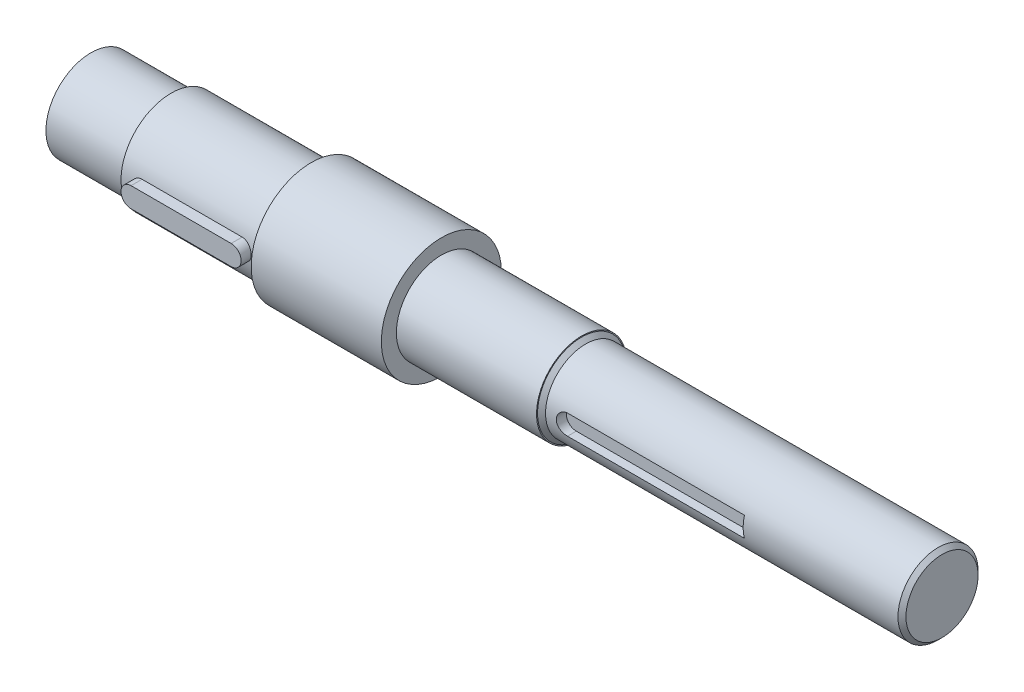
ISO-10303-21;
HEADER;
FILE_DESCRIPTION(('STEP AP214'),'2;1');
FILE_NAME('part.step','',(''),(''),'','','');
FILE_SCHEMA(('AUTOMOTIVE_DESIGN { 1 0 10303 214 1 1 1 1 }'));
ENDSEC;
DATA;
#1=APPLICATION_CONTEXT('core data for automotive mechanical design processes');
#2=APPLICATION_PROTOCOL_DEFINITION('international standard','automotive_design',2000,#1);
#3=PRODUCT_CONTEXT('',#1,'mechanical');
#4=PRODUCT('Part','Part','',(#3));
#5=PRODUCT_RELATED_PRODUCT_CATEGORY('part','',(#4));
#6=PRODUCT_DEFINITION_FORMATION('','',#4);
#7=PRODUCT_DEFINITION_CONTEXT('part definition',#1,'design');
#8=PRODUCT_DEFINITION('design','',#6,#7);
#9=PRODUCT_DEFINITION_SHAPE('','',#8);
#10=(LENGTH_UNIT() NAMED_UNIT(*) SI_UNIT(.MILLI.,.METRE.));
#11=(NAMED_UNIT(*) PLANE_ANGLE_UNIT() SI_UNIT($,.RADIAN.));
#12=(NAMED_UNIT(*) SI_UNIT($,.STERADIAN.) SOLID_ANGLE_UNIT());
#13=UNCERTAINTY_MEASURE_WITH_UNIT(LENGTH_MEASURE(1.E-05),#10,'distance_accuracy_value','');
#14=(GEOMETRIC_REPRESENTATION_CONTEXT(3) GLOBAL_UNCERTAINTY_ASSIGNED_CONTEXT((#13)) GLOBAL_UNIT_ASSIGNED_CONTEXT((#10,
#11,#12)) REPRESENTATION_CONTEXT('',''));
#15=CARTESIAN_POINT('',(0.,0.,0.));
#16=DIRECTION('',(0.,0.,1.));
#17=DIRECTION('',(1.,0.,0.));
#18=AXIS2_PLACEMENT_3D('',#15,#16,#17);
#19=CARTESIAN_POINT('',(325.,0.,0.));
#20=DIRECTION('',(1.,0.,0.));
#21=DIRECTION('',(0.,0.,-1.));
#22=AXIS2_PLACEMENT_3D('',#19,#20,#21);
#23=CYLINDRICAL_SURFACE('',#22,20.);
#24=DIRECTION('',(1.,0.,0.));
#25=VECTOR('',#24,1.);
#26=CARTESIAN_POINT('',(325.,-5.,19.3649167310371));
#27=LINE('',#26,#25);
#28=CARTESIAN_POINT('',(345.693163578946,-5.,19.3649167310371));
#29=VERTEX_POINT('',#28);
#30=CARTESIAN_POINT('',(257.357014360562,-5.,19.3649167310371));
#31=VERTEX_POINT('',#30);
#32=EDGE_CURVE('E65',#29,#31,#27,.F.);
#33=ORIENTED_EDGE('',*,*,#32,.T.);
#34=CARTESIAN_POINT('',(257.357014360562,-5.,19.3649167310371));
#35=CARTESIAN_POINT('',(257.218741410235,-5.00001753405856,19.3649007839448));
#36=CARTESIAN_POINT('',(257.080474031308,-4.9942649594992,19.3663971752211));
#37=CARTESIAN_POINT('',(256.804973201738,-4.97134855568943,19.3722985604214));
#38=CARTESIAN_POINT('',(256.667739581045,-4.95418664661752,19.3767030649124));
#39=CARTESIAN_POINT('',(256.39555097828,-4.90862550526641,19.3882932151163));
#40=CARTESIAN_POINT('',(256.260592030224,-4.8802485399566,19.395473349332));
#41=CARTESIAN_POINT('',(255.993627598963,-4.8124981930994,19.4123951927565));
#42=CARTESIAN_POINT('',(255.8616221564,-4.77312466032893,19.4221369371921));
#43=CARTESIAN_POINT('',(255.601517220398,-4.68370982441759,19.4438929800907));
#44=CARTESIAN_POINT('',(255.473416514375,-4.63367187241133,19.4559065645285));
#45=CARTESIAN_POINT('',(255.221886629321,-4.52328421223625,19.4818662950644));
#46=CARTESIAN_POINT('',(255.098459203696,-4.4629306796091,19.4958131575534));
#47=CARTESIAN_POINT('',(254.857143285893,-4.33237373804702,19.5252403930813));
#48=CARTESIAN_POINT('',(254.739254077098,-4.26217160818173,19.5407205669073));
#49=CARTESIAN_POINT('',(254.509702438924,-4.11237230752997,19.5727939032117));
#50=CARTESIAN_POINT('',(254.398042375446,-4.03277160234962,19.5893874833745));
#51=CARTESIAN_POINT('',(254.179602288399,-3.86310059131535,19.6235594213257));
#52=CARTESIAN_POINT('',(254.072958349297,-3.77285762537103,19.6411506158731));
#53=CARTESIAN_POINT('',(253.867571111575,-3.58375217632145,19.6765336016142));
#54=CARTESIAN_POINT('',(253.768830760125,-3.48488650634642,19.6943254648398));
#55=CARTESIAN_POINT('',(253.579962543264,-3.27923259691246,19.7296100663421));
#56=CARTESIAN_POINT('',(253.489832921767,-3.17244598079041,19.7471028650105));
#57=CARTESIAN_POINT('',(253.318739858616,-2.95158589140583,19.781320245822));
#58=CARTESIAN_POINT('',(253.237779806131,-2.83750974806656,19.7980445425702));
#59=CARTESIAN_POINT('',(253.084593656647,-2.60125165700148,19.8304789838686));
#60=CARTESIAN_POINT('',(253.012501461753,-2.4789805031238,19.846172223018));
#61=CARTESIAN_POINT('',(252.878871982133,-2.2285404858788,19.8758524753698));
#62=CARTESIAN_POINT('',(252.817338688003,-2.10036941582537,19.8898388429088));
#63=CARTESIAN_POINT('',(252.705374876027,-1.83913888991785,19.9156918575848));
#64=CARTESIAN_POINT('',(252.654938418928,-1.70608209372191,19.9275596379879));
#65=CARTESIAN_POINT('',(252.565525439476,-1.43592780474634,19.9488465917985));
#66=CARTESIAN_POINT('',(252.526553030436,-1.29882888101133,19.9582648861874));
#67=CARTESIAN_POINT('',(252.461111794983,-1.02449944050252,19.9742050419042));
#68=CARTESIAN_POINT('',(252.434401759068,-0.887329906187969,19.9807826130628));
#69=CARTESIAN_POINT('',(252.392532166258,-0.61112147007305,19.9911405771331));
#70=CARTESIAN_POINT('',(252.377376855634,-0.47208190013247,19.9949199417111));
#71=CARTESIAN_POINT('',(252.349525995907,-0.0538316503971066,20.0018595987671));
#72=CARTESIAN_POINT('',(252.354364629471,0.226850517941071,20.0006416404337));
#73=CARTESIAN_POINT('',(252.410156239347,0.776805470835619,19.9867651529638));
#74=CARTESIAN_POINT('',(252.460083279682,1.04619321655979,19.9743611583353));
#75=CARTESIAN_POINT('',(252.602961920538,1.57268384713161,19.9398153073034));
#76=CARTESIAN_POINT('',(252.695915424676,1.82978618788151,19.9176730200515));
#77=CARTESIAN_POINT('',(252.923011968746,2.32703221656296,19.8657515159188));
#78=CARTESIAN_POINT('',(253.057520231614,2.56700133265149,19.835904985373));
#79=CARTESIAN_POINT('',(253.36376111453,3.02140997555177,19.7717919823027));
#80=CARTESIAN_POINT('',(253.535499342586,3.23584564867366,19.7375248442104));
#81=CARTESIAN_POINT('',(253.819927784376,3.53678494662043,19.6850697901596));
#82=CARTESIAN_POINT('',(253.920753671691,3.63481635600628,19.6671607784857));
#83=CARTESIAN_POINT('',(254.130317007796,3.82205900545833,19.6316306769696));
#84=CARTESIAN_POINT('',(254.239051654558,3.91127334319107,19.6140094878371));
#85=CARTESIAN_POINT('',(254.463797091708,4.08032945790285,19.5795395310849));
#86=CARTESIAN_POINT('',(254.579812624056,4.16016502733274,19.5626912794969));
#87=CARTESIAN_POINT('',(254.818248826518,4.30981088668676,19.5302685472816));
#88=CARTESIAN_POINT('',(254.940666999543,4.37962504585707,19.5146935760486));
#89=CARTESIAN_POINT('',(255.191854582385,4.50912025416738,19.4851808747872));
#90=CARTESIAN_POINT('',(255.320656784817,4.56874001933992,19.4712531918425));
#91=CARTESIAN_POINT('',(255.582999390997,4.67685682835969,19.4455675792789));
#92=CARTESIAN_POINT('',(255.716537879086,4.72535831123083,19.4338087840894));
#93=CARTESIAN_POINT('',(255.987298522453,4.81082238230289,19.4128288796263));
#94=CARTESIAN_POINT('',(256.124516702289,4.84779691847633,19.4036051438817));
#95=CARTESIAN_POINT('',(256.401700534934,4.9099426208801,19.3879727962744));
#96=CARTESIAN_POINT('',(256.541664868478,4.93511931688208,19.3815628656409));
#97=CARTESIAN_POINT('',(256.794271834071,4.96951196173161,19.3727696898981));
#98=CARTESIAN_POINT('',(256.906598173399,4.98094835236985,19.3698287297098));
#99=CARTESIAN_POINT('',(257.131617989406,4.99618938185625,19.365900549509));
#100=CARTESIAN_POINT('',(257.244310575182,5.00000636815257,19.3649101685657));
#101=CARTESIAN_POINT('',(257.357014360562,5.,19.3649167310371));
#102=B_SPLINE_CURVE_WITH_KNOTS('',3,(#34,#35,#36,#37,#38,#39,#40,#41,#42,#43,#44,#45,#46,#47,
#48,#49,#50,#51,#52,#53,#54,#55,#56,#57,#58,#59,#60,#61,#62,#63,#64,#65,#66,#67,#68,#69,#70,#71,
#72,#73,#74,#75,#76,#77,#78,#79,#80,#81,#82,#83,#84,#85,#86,#87,#88,#89,#90,#91,#92,#93,#94,#95,
#96,#97,#98,#99,#100,#101),.UNSPECIFIED.,.F.,.F.,(4,2,2,2,2,2,2,2,2,2,2,2,2,2,2,2,2,2,2,2,2,2,2,
2,2,2,2,2,2,2,2,2,2,4),(0.,0.414682651698812,0.829295530423234,1.24308931715182,
1.65688879458828,2.07055843292849,2.48438177155301,2.89815141525148,3.3120771582294,
3.73400550955301,4.15609046783011,4.57808916078638,5.00024332341806,5.42814441562206,
5.85620687281817,6.28403966195077,6.71202577127489,7.13118853175626,7.5505052571135,
8.38810249417921,9.20710845531106,10.0261506551392,10.852606653866,11.6791872295637,
12.104066664202,12.5287962930148,12.95380547348,13.3786501148241,13.8059651975176,
14.2331093744515,14.6598093221411,15.0863090705412,15.4248791296956,15.7629000801682),.UNSPECIFIED.);
#103=CARTESIAN_POINT('',(257.357014360562,5.,19.3649167310371));
#104=VERTEX_POINT('',#103);
#105=EDGE_CURVE('E194',#31,#104,#102,.T.);
#106=ORIENTED_EDGE('',*,*,#105,.T.);
#107=DIRECTION('',(1.,0.,0.));
#108=VECTOR('',#107,1.);
#109=CARTESIAN_POINT('',(325.,5.,19.3649167310371));
#110=LINE('',#109,#108);
#111=CARTESIAN_POINT('',(345.693163578946,5.,19.3649167310371));
#112=VERTEX_POINT('',#111);
#113=EDGE_CURVE('E465',#104,#112,#110,.T.);
#114=ORIENTED_EDGE('',*,*,#113,.T.);
#115=CARTESIAN_POINT('',(345.693163578946,0.,0.));
#116=DIRECTION('',(1.,0.,0.));
#117=DIRECTION('',(0.,0.,-1.));
#118=AXIS2_PLACEMENT_3D('',#115,#116,#117);
#119=CIRCLE('',#118,20.);
#120=EDGE_CURVE('E57',#112,#29,#119,.T.);
#121=ORIENTED_EDGE('',*,*,#120,.T.);
#122=EDGE_LOOP('',(#33,#106,#114,#121));
#123=FACE_BOUND('',#122,.T.);
#124=CARTESIAN_POINT('',(247.,0.,0.));
#125=DIRECTION('',(-1.,0.,0.));
#126=DIRECTION('',(0.,0.,1.));
#127=AXIS2_PLACEMENT_3D('',#124,#125,#126);
#128=CIRCLE('',#127,20.);
#129=CARTESIAN_POINT('',(247.,0.,20.));
#130=VERTEX_POINT('',#129);
#131=EDGE_CURVE('E185',#130,#130,#128,.F.);
#132=ORIENTED_EDGE('',*,*,#131,.T.);
#133=EDGE_LOOP('',(#132));
#134=FACE_BOUND('',#133,.T.);
#135=CARTESIAN_POINT('',(423.,0.,0.));
#136=DIRECTION('',(-1.,0.,0.));
#137=DIRECTION('',(0.,0.,1.));
#138=AXIS2_PLACEMENT_3D('',#135,#136,#137);
#139=CIRCLE('',#138,20.);
#140=CARTESIAN_POINT('',(423.,0.,20.));
#141=VERTEX_POINT('',#140);
#142=EDGE_CURVE('E182',#141,#141,#139,.T.);
#143=ORIENTED_EDGE('',*,*,#142,.T.);
#144=EDGE_LOOP('',(#143));
#145=FACE_BOUND('',#144,.T.);
#146=ADVANCED_FACE('F41',(#123,#134,#145),#23,.T.);
#147=CARTESIAN_POINT('',(245.,0.,0.));
#148=DIRECTION('',(-1.,0.,0.));
#149=DIRECTION('',(0.,0.,1.));
#150=AXIS2_PLACEMENT_3D('',#147,#148,#149);
#151=PLANE('',#150);
#152=CARTESIAN_POINT('',(245.,0.,0.));
#153=DIRECTION('',(-1.,0.,0.));
#154=DIRECTION('',(0.,0.,1.));
#155=AXIS2_PLACEMENT_3D('',#152,#153,#154);
#156=CIRCLE('',#155,22.0000000000001);
#157=CARTESIAN_POINT('',(245.,0.,22.0000000000001));
#158=VERTEX_POINT('',#157);
#159=EDGE_CURVE('E188',#158,#158,#156,.T.);
#160=ORIENTED_EDGE('',*,*,#159,.T.);
#161=EDGE_LOOP('',(#160));
#162=FACE_BOUND('',#161,.T.);
#163=CARTESIAN_POINT('',(245.,0.,0.));
#164=DIRECTION('',(1.,0.,0.));
#165=DIRECTION('',(0.,0.,-1.));
#166=AXIS2_PLACEMENT_3D('',#163,#164,#165);
#167=CIRCLE('',#166,22.5);
#168=CARTESIAN_POINT('',(245.,0.,-22.5));
#169=VERTEX_POINT('',#168);
#170=EDGE_CURVE('E179',#169,#169,#167,.T.);
#171=ORIENTED_EDGE('',*,*,#170,.T.);
#172=EDGE_LOOP('',(#171));
#173=FACE_BOUND('',#172,.T.);
#174=ADVANCED_FACE('F270',(#162,#173),#151,.F.);
#175=CARTESIAN_POINT('',(325.,0.,0.));
#176=DIRECTION('',(1.,0.,0.));
#177=DIRECTION('',(0.,0.,-1.));
#178=AXIS2_PLACEMENT_3D('',#175,#176,#177);
#179=CYLINDRICAL_SURFACE('',#178,22.5);
#180=ORIENTED_EDGE('',*,*,#170,.F.);
#181=EDGE_LOOP('',(#180));
#182=FACE_BOUND('',#181,.T.);
#183=CARTESIAN_POINT('',(175.,0.,0.));
#184=DIRECTION('',(1.,0.,0.));
#185=DIRECTION('',(0.,0.,-1.));
#186=AXIS2_PLACEMENT_3D('',#183,#184,#185);
#187=CIRCLE('',#186,22.5);
#188=CARTESIAN_POINT('',(175.,0.,-22.5));
#189=VERTEX_POINT('',#188);
#190=EDGE_CURVE('E176',#189,#189,#187,.T.);
#191=ORIENTED_EDGE('',*,*,#190,.T.);
#192=EDGE_LOOP('',(#191));
#193=FACE_BOUND('',#192,.T.);
#194=ADVANCED_FACE('F275',(#182,#193),#179,.T.);
#195=CARTESIAN_POINT('',(175.,0.,0.));
#196=DIRECTION('',(-1.,0.,0.));
#197=DIRECTION('',(0.,0.,1.));
#198=AXIS2_PLACEMENT_3D('',#195,#196,#197);
#199=PLANE('',#198);
#200=ORIENTED_EDGE('',*,*,#190,.F.);
#201=EDGE_LOOP('',(#200));
#202=FACE_BOUND('',#201,.T.);
#203=CARTESIAN_POINT('',(175.,0.,0.));
#204=DIRECTION('',(1.,0.,0.));
#205=DIRECTION('',(0.,0.,-1.));
#206=AXIS2_PLACEMENT_3D('',#203,#204,#205);
#207=CIRCLE('',#206,30.);
#208=CARTESIAN_POINT('',(175.,0.,-30.));
#209=VERTEX_POINT('',#208);
#210=EDGE_CURVE('E173',#209,#209,#207,.T.);
#211=ORIENTED_EDGE('',*,*,#210,.T.);
#212=EDGE_LOOP('',(#211));
#213=FACE_BOUND('',#212,.T.);
#214=ADVANCED_FACE('F303',(#202,#213),#199,.F.);
#215=CARTESIAN_POINT('',(325.,0.,0.));
#216=DIRECTION('',(1.,0.,0.));
#217=DIRECTION('',(0.,0.,-1.));
#218=AXIS2_PLACEMENT_3D('',#215,#216,#217);
#219=CYLINDRICAL_SURFACE('',#218,30.);
#220=ORIENTED_EDGE('',*,*,#210,.F.);
#221=EDGE_LOOP('',(#220));
#222=FACE_BOUND('',#221,.T.);
#223=CARTESIAN_POINT('',(110.,0.,0.));
#224=DIRECTION('',(1.,0.,0.));
#225=DIRECTION('',(0.,0.,-1.));
#226=AXIS2_PLACEMENT_3D('',#223,#224,#225);
#227=CIRCLE('',#226,30.);
#228=CARTESIAN_POINT('',(110.,0.,-30.));
#229=VERTEX_POINT('',#228);
#230=EDGE_CURVE('E170',#229,#229,#227,.T.);
#231=ORIENTED_EDGE('',*,*,#230,.T.);
#232=EDGE_LOOP('',(#231));
#233=FACE_BOUND('',#232,.T.);
#234=ADVANCED_FACE('F309',(#222,#233),#219,.T.);
#235=CARTESIAN_POINT('',(110.,0.,0.));
#236=DIRECTION('',(1.,0.,0.));
#237=DIRECTION('',(0.,0.,-1.));
#238=AXIS2_PLACEMENT_3D('',#235,#236,#237);
#239=PLANE('',#238);
#240=ORIENTED_EDGE('',*,*,#230,.F.);
#241=EDGE_LOOP('',(#240));
#242=FACE_BOUND('',#241,.T.);
#243=CARTESIAN_POINT('',(110.,0.,0.));
#244=DIRECTION('',(1.,0.,0.));
#245=DIRECTION('',(0.,0.,-1.));
#246=AXIS2_PLACEMENT_3D('',#243,#244,#245);
#247=CIRCLE('',#246,25.);
#248=CARTESIAN_POINT('',(110.,0.,-25.));
#249=VERTEX_POINT('',#248);
#250=EDGE_CURVE('E167',#249,#249,#247,.T.);
#251=ORIENTED_EDGE('',*,*,#250,.T.);
#252=EDGE_LOOP('',(#251));
#253=FACE_BOUND('',#252,.T.);
#254=ADVANCED_FACE('F243',(#242,#253),#239,.F.);
#255=CARTESIAN_POINT('',(325.,0.,0.));
#256=DIRECTION('',(1.,0.,0.));
#257=DIRECTION('',(0.,0.,-1.));
#258=AXIS2_PLACEMENT_3D('',#255,#256,#257);
#259=CYLINDRICAL_SURFACE('',#258,25.);
#260=DIRECTION('',(1.,0.,0.));
#261=VECTOR('',#260,1.);
#262=CARTESIAN_POINT('',(325.,-4.99999999999999,24.4948974278317));
#263=LINE('',#262,#261);
#264=CARTESIAN_POINT('',(100.,-4.99999999999999,24.4948974278317));
#265=VERTEX_POINT('',#264);
#266=CARTESIAN_POINT('',(50.,-4.99999999999999,24.4948974278317));
#267=VERTEX_POINT('',#266);
#268=EDGE_CURVE('E11',#265,#267,#263,.F.);
#269=ORIENTED_EDGE('',*,*,#268,.T.);
#270=CARTESIAN_POINT('',(50.,-4.99999999999999,24.4948974278317));
#271=CARTESIAN_POINT('',(49.8608746733586,-5.00001666827265,24.4948849644864));
#272=CARTESIAN_POINT('',(49.7217536599755,-4.99419397242177,24.4960823045703));
#273=CARTESIAN_POINT('',(49.4445351564728,-4.97099170943313,24.50080611049));
#274=CARTESIAN_POINT('',(49.3064375418745,-4.95361357194362,24.5043322881998));
#275=CARTESIAN_POINT('',(49.0324541896029,-4.90745732970079,24.513616269194));
#276=CARTESIAN_POINT('',(48.8965654091493,-4.87869659169541,24.5193706725256));
#277=CARTESIAN_POINT('',(48.6277465948128,-4.81000656952587,24.5329384582686));
#278=CARTESIAN_POINT('',(48.4948165730108,-4.77007723976851,24.5407518490854));
#279=CARTESIAN_POINT('',(48.2328545432776,-4.67935997504847,24.5582108316481));
#280=CARTESIAN_POINT('',(48.1038221700404,-4.62857306133624,24.5678562510663));
#281=CARTESIAN_POINT('',(47.8504771779982,-4.51649698965019,24.5887068281803));
#282=CARTESIAN_POINT('',(47.7261663265332,-4.45520394548308,24.5999125627442));
#283=CARTESIAN_POINT('',(47.4831843387933,-4.32259070656745,24.6235607101597));
#284=CARTESIAN_POINT('',(47.3645116094537,-4.25127336702451,24.6360027705756));
#285=CARTESIAN_POINT('',(47.13351015526,-4.09907006911224,24.6617838379426));
#286=CARTESIAN_POINT('',(47.0211838230565,-4.01818053703545,24.6751231790797));
#287=CARTESIAN_POINT('',(46.8023320473306,-3.84636310105367,24.7024927456792));
#288=CARTESIAN_POINT('',(46.6958940844013,-3.75532477701365,24.7165294141223));
#289=CARTESIAN_POINT('',(46.4909994353279,-3.5646192180849,24.7447526144403));
#290=CARTESIAN_POINT('',(46.3925457218073,-3.46494879767301,24.7589391999292));
#291=CARTESIAN_POINT('',(46.2043496381155,-3.25770259068244,24.7870592087541));
#292=CARTESIAN_POINT('',(46.1146054360279,-3.1501284749292,24.8009926848246));
#293=CARTESIAN_POINT('',(45.9443911266601,-2.92773828992182,24.8282278973015));
#294=CARTESIAN_POINT('',(45.8639244496867,-2.81291956614295,24.8415293989775));
#295=CARTESIAN_POINT('',(45.7122386617998,-2.57586261860517,24.8672326807152));
#296=CARTESIAN_POINT('',(45.6411024393023,-2.4535704158378,24.8796260142365));
#297=CARTESIAN_POINT('',(45.5093749801634,-2.20324717771263,24.9030421535278));
#298=CARTESIAN_POINT('',(45.4487876982792,-2.0752140126138,24.914064444859));
#299=CARTESIAN_POINT('',(45.3386791563826,-1.81441746775921,24.9344136360483));
#300=CARTESIAN_POINT('',(45.2891524015655,-1.68165647494043,24.9437413773172));
#301=CARTESIAN_POINT('',(45.2014979823061,-1.41225203764251,24.9604441197165));
#302=CARTESIAN_POINT('',(45.1633744441311,-1.27560720732983,24.9678184138796));
#303=CARTESIAN_POINT('',(45.0992973504455,-1.0013301067078,24.9803102866208));
#304=CARTESIAN_POINT('',(45.0731862248938,-0.86373616415733,24.9854570281343));
#305=CARTESIAN_POINT('',(45.0325735068729,-0.586784276733809,24.9934984482444));
#306=CARTESIAN_POINT('',(45.0180759451443,-0.447425736450265,24.9963923449321));
#307=CARTESIAN_POINT('',(44.992277906006,-0.0282339145439789,25.0015345303172));
#308=CARTESIAN_POINT('',(44.9985975119357,0.253035346754806,25.0002582152218));
#309=CARTESIAN_POINT('',(45.0429657990685,0.668581641108663,24.9914408151569));
#310=CARTESIAN_POINT('',(45.0633185534661,0.80513866275584,24.9874010387133));
#311=CARTESIAN_POINT('',(45.1152154304247,1.07603260238651,24.9771983765684));
#312=CARTESIAN_POINT('',(45.1467556606671,1.21037027552906,24.9710362292986));
#313=CARTESIAN_POINT('',(45.2208065658248,1.47591760067315,24.9567501974577));
#314=CARTESIAN_POINT('',(45.2633212413286,1.60712609287946,24.9486255975703));
#315=CARTESIAN_POINT('',(45.3589766079297,1.86543814373861,24.9306416146559));
#316=CARTESIAN_POINT('',(45.4121136165417,1.99254310728993,24.9207828329663));
#317=CARTESIAN_POINT('',(45.5290237293243,2.24266742779431,24.8995241961169));
#318=CARTESIAN_POINT('',(45.5928653730387,2.36565390182105,24.8881145061703));
#319=CARTESIAN_POINT('',(45.7304498137618,2.6057785531881,24.8641202109372));
#320=CARTESIAN_POINT('',(45.8041891503838,2.72291875492853,24.8515360167419));
#321=CARTESIAN_POINT('',(45.9611051158086,2.95067106820489,24.8255248721503));
#322=CARTESIAN_POINT('',(46.0442857003174,3.0612804137093,24.8120975695678));
#323=CARTESIAN_POINT('',(46.2194621490239,3.27515412500652,24.7847732726215));
#324=CARTESIAN_POINT('',(46.3114549296687,3.3784210381766,24.7708764436475));
#325=CARTESIAN_POINT('',(46.5053715364178,3.57873527346884,24.7427376365477));
#326=CARTESIAN_POINT('',(46.6074423503734,3.67564011377472,24.7284939036525));
#327=CARTESIAN_POINT('',(46.8193724145075,3.86048859181168,24.7003111004447));
#328=CARTESIAN_POINT('',(46.9292288528081,3.94843543715,24.6863719224938));
#329=CARTESIAN_POINT('',(47.156093810237,4.11485123813351,24.6591791231741));
#330=CARTESIAN_POINT('',(47.2731069879703,4.19331391911306,24.6459259589468));
#331=CARTESIAN_POINT('',(47.5133767207476,4.34010555279844,24.6205002572596));
#332=CARTESIAN_POINT('',(47.6366308738237,4.40843836501602,24.6083273089474));
#333=CARTESIAN_POINT('',(47.888966472899,4.53469984736733,24.5853743099635));
#334=CARTESIAN_POINT('',(48.018064826951,4.59259554826929,24.5745987023543));
#335=CARTESIAN_POINT('',(48.280770616613,4.69725810665846,24.5548081643222));
#336=CARTESIAN_POINT('',(48.4143762671951,4.74402931205847,24.5457925462704));
#337=CARTESIAN_POINT('',(48.6850402470559,4.82606031456237,24.5297959324801));
#338=CARTESIAN_POINT('',(48.8220948160494,4.86133210938726,24.5228128169847));
#339=CARTESIAN_POINT('',(49.0987375289509,4.92013311165957,24.5110829912476));
#340=CARTESIAN_POINT('',(49.2383244351831,4.943667903404,24.5063352175227));
#341=CARTESIAN_POINT('',(49.4817592018376,4.97415554156175,24.5001622999759));
#342=CARTESIAN_POINT('',(49.5852582681504,4.9838517075934,24.498189711568));
#343=CARTESIAN_POINT('',(49.7925017305639,4.99677038633665,24.4955566519276));
#344=CARTESIAN_POINT('',(49.8962454237314,5.00000373289603,24.4948939848492));
#345=CARTESIAN_POINT('',(50.,5.00000000000001,24.4948974278317));
#346=B_SPLINE_CURVE_WITH_KNOTS('',3,(#270,#271,#272,#273,#274,#275,#276,#277,#278,#279,#280,
#281,#282,#283,#284,#285,#286,#287,#288,#289,#290,#291,#292,#293,#294,#295,#296,#297,#298,#299,
#300,#301,#302,#303,#304,#305,#306,#307,#308,#309,#310,#311,#312,#313,#314,#315,#316,#317,#318,
#319,#320,#321,#322,#323,#324,#325,#326,#327,#328,#329,#330,#331,#332,#333,#334,#335,#336,#337,
#338,#339,#340,#341,#342,#343,#344,#345),.UNSPECIFIED.,.F.,.F.,(4,2,2,2,2,2,2,2,2,2,2,2,2,2,2,2,
2,2,2,2,2,2,2,2,2,2,2,2,2,2,2,2,2,2,2,2,2,4),(0.,0.417242551789613,0.834433491607678,
1.25099035047397,1.66754890986221,2.08406830550987,2.50074210451561,2.91729746251716,
3.33400883196917,3.75580364592262,4.17775478454163,4.59961697876818,5.02163465704725,
5.44717860948248,5.87288175479563,6.29837294048708,6.72401790492143,7.14390813062633,
7.56394402533169,8.40304192223057,8.8170508197205,9.23091581733351,9.64493189752781,
10.0588046972975,10.4754363941303,10.8919228076445,11.3085843698369,11.7251006632377,
12.1489910901879,12.5727291962766,12.9967461280637,13.4206010905545,13.8457723408149,
14.2707771424992,14.6953370927157,15.1196948502477,15.4314077968161,15.7425977684821),.UNSPECIFIED.);
#347=CARTESIAN_POINT('',(50.,5.00000000000001,24.4948974278317));
#348=VERTEX_POINT('',#347);
#349=EDGE_CURVE('E248',#267,#348,#346,.T.);
#350=ORIENTED_EDGE('',*,*,#349,.T.);
#351=DIRECTION('',(1.,0.,0.));
#352=VECTOR('',#351,1.);
#353=CARTESIAN_POINT('',(325.,5.00000000000001,24.4948974278317));
#354=LINE('',#353,#352);
#355=CARTESIAN_POINT('',(100.,5.00000000000001,24.4948974278317));
#356=VERTEX_POINT('',#355);
#357=EDGE_CURVE('E50',#348,#356,#354,.T.);
#358=ORIENTED_EDGE('',*,*,#357,.T.);
#359=CARTESIAN_POINT('',(100.,5.00000000000001,24.4948974278317));
#360=CARTESIAN_POINT('',(100.139125326641,5.00001666827266,24.4948849644864));
#361=CARTESIAN_POINT('',(100.278246340025,4.99419397242178,24.4960823045703));
#362=CARTESIAN_POINT('',(100.555464843527,4.97099170943314,24.50080611049));
#363=CARTESIAN_POINT('',(100.693562458126,4.95361357194364,24.5043322881998));
#364=CARTESIAN_POINT('',(100.967545810397,4.90745732970081,24.513616269194));
#365=CARTESIAN_POINT('',(101.103434590851,4.87869659169543,24.5193706725256));
#366=CARTESIAN_POINT('',(101.372253405187,4.81000656952588,24.5329384582686));
#367=CARTESIAN_POINT('',(101.505183426989,4.77007723976853,24.5407518490854));
#368=CARTESIAN_POINT('',(101.767145456722,4.67935997504849,24.5582108316481));
#369=CARTESIAN_POINT('',(101.89617782996,4.62857306133626,24.5678562510663));
#370=CARTESIAN_POINT('',(102.149522822002,4.51649698965022,24.5887068281803));
#371=CARTESIAN_POINT('',(102.273833673467,4.4552039454831,24.5999125627442));
#372=CARTESIAN_POINT('',(102.516815661207,4.32259070656748,24.6235607101597));
#373=CARTESIAN_POINT('',(102.635488390546,4.25127336702454,24.6360027705756));
#374=CARTESIAN_POINT('',(102.86648984474,4.09907006911227,24.6617838379426));
#375=CARTESIAN_POINT('',(102.978816176943,4.01818053703548,24.6751231790797));
#376=CARTESIAN_POINT('',(103.197667952669,3.8463631010537,24.7024927456792));
#377=CARTESIAN_POINT('',(103.304105915599,3.75532477701368,24.7165294141223));
#378=CARTESIAN_POINT('',(103.509000564672,3.56461921808493,24.7447526144403));
#379=CARTESIAN_POINT('',(103.607454278193,3.46494879767304,24.7589391999292));
#380=CARTESIAN_POINT('',(103.795650361884,3.25770259068247,24.7870592087541));
#381=CARTESIAN_POINT('',(103.885394563972,3.15012847492923,24.8009926848246));
#382=CARTESIAN_POINT('',(104.05560887334,2.92773828992185,24.8282278973015));
#383=CARTESIAN_POINT('',(104.136075550313,2.81291956614298,24.8415293989775));
#384=CARTESIAN_POINT('',(104.2877613382,2.5758626186052,24.8672326807152));
#385=CARTESIAN_POINT('',(104.358897560698,2.45357041583782,24.8796260142365));
#386=CARTESIAN_POINT('',(104.490625019837,2.20324717771266,24.9030421535278));
#387=CARTESIAN_POINT('',(104.551212301721,2.07521401261383,24.914064444859));
#388=CARTESIAN_POINT('',(104.661320843617,1.81441746775923,24.9344136360483));
#389=CARTESIAN_POINT('',(104.710847598434,1.68165647494045,24.9437413773172));
#390=CARTESIAN_POINT('',(104.798502017694,1.41225203764253,24.9604441197165));
#391=CARTESIAN_POINT('',(104.836625555869,1.27560720732984,24.9678184138796));
#392=CARTESIAN_POINT('',(104.900702649554,1.00133010670782,24.9803102866208));
#393=CARTESIAN_POINT('',(104.926813775106,0.863736164157348,24.9854570281343));
#394=CARTESIAN_POINT('',(104.967426493127,0.586784276733828,24.9934984482444));
#395=CARTESIAN_POINT('',(104.981924054856,0.447425736450286,24.9963923449321));
#396=CARTESIAN_POINT('',(105.007722093994,0.0282339145440016,25.0015345303172));
#397=CARTESIAN_POINT('',(105.001402488064,-0.253035346754783,25.0002582152218));
#398=CARTESIAN_POINT('',(104.957034200932,-0.668581641108637,24.9914408151569));
#399=CARTESIAN_POINT('',(104.936681446534,-0.805138662755814,24.9874010387133));
#400=CARTESIAN_POINT('',(104.884784569575,-1.07603260238648,24.9771983765684));
#401=CARTESIAN_POINT('',(104.853244339333,-1.21037027552904,24.9710362292986));
#402=CARTESIAN_POINT('',(104.779193434175,-1.47591760067313,24.9567501974577));
#403=CARTESIAN_POINT('',(104.736678758671,-1.60712609287944,24.9486255975703));
#404=CARTESIAN_POINT('',(104.64102339207,-1.86543814373859,24.9306416146559));
#405=CARTESIAN_POINT('',(104.587886383458,-1.99254310728991,24.9207828329663));
#406=CARTESIAN_POINT('',(104.470976270676,-2.24266742779429,24.8995241961169));
#407=CARTESIAN_POINT('',(104.407134626961,-2.36565390182103,24.8881145061703));
#408=CARTESIAN_POINT('',(104.269550186238,-2.60577855318808,24.8641202109372));
#409=CARTESIAN_POINT('',(104.195810849616,-2.72291875492851,24.8515360167419));
#410=CARTESIAN_POINT('',(104.038894884191,-2.95067106820486,24.8255248721503));
#411=CARTESIAN_POINT('',(103.955714299683,-3.06128041370928,24.8120975695679));
#412=CARTESIAN_POINT('',(103.780537850976,-3.2751541250065,24.7847732726215));
#413=CARTESIAN_POINT('',(103.688545070331,-3.37842103817658,24.7708764436475));
#414=CARTESIAN_POINT('',(103.494628463582,-3.57873527346882,24.7427376365477));
#415=CARTESIAN_POINT('',(103.392557649627,-3.6756401137747,24.7284939036525));
#416=CARTESIAN_POINT('',(103.180627585493,-3.86048859181165,24.7003111004447));
#417=CARTESIAN_POINT('',(103.070771147192,-3.94843543714998,24.6863719224938));
#418=CARTESIAN_POINT('',(102.843906189763,-4.11485123813349,24.6591791231741));
#419=CARTESIAN_POINT('',(102.72689301203,-4.19331391911304,24.6459259589468));
#420=CARTESIAN_POINT('',(102.486623279252,-4.34010555279842,24.6205002572596));
#421=CARTESIAN_POINT('',(102.363369126176,-4.408438365016,24.6083273089475));
#422=CARTESIAN_POINT('',(102.111033527101,-4.53469984736731,24.5853743099635));
#423=CARTESIAN_POINT('',(101.981935173049,-4.59259554826927,24.5745987023543));
#424=CARTESIAN_POINT('',(101.719229383387,-4.69725810665843,24.5548081643222));
#425=CARTESIAN_POINT('',(101.585623732805,-4.74402931205845,24.5457925462705));
#426=CARTESIAN_POINT('',(101.314959752944,-4.82606031456234,24.5297959324801));
#427=CARTESIAN_POINT('',(101.177905183951,-4.86133210938723,24.5228128169847));
#428=CARTESIAN_POINT('',(100.901262471049,-4.92013311165955,24.5110829912476));
#429=CARTESIAN_POINT('',(100.761675564817,-4.94366790340398,24.5063352175227));
#430=CARTESIAN_POINT('',(100.518240798162,-4.97415554156173,24.5001622999759));
#431=CARTESIAN_POINT('',(100.41474173185,-4.98385170759338,24.498189711568));
#432=CARTESIAN_POINT('',(100.207498269436,-4.99677038633663,24.4955566519276));
#433=CARTESIAN_POINT('',(100.103754576269,-5.00000373289602,24.4948939848492));
#434=CARTESIAN_POINT('',(100.,-4.99999999999999,24.4948974278317));
#435=B_SPLINE_CURVE_WITH_KNOTS('',3,(#359,#360,#361,#362,#363,#364,#365,#366,#367,#368,#369,
#370,#371,#372,#373,#374,#375,#376,#377,#378,#379,#380,#381,#382,#383,#384,#385,#386,#387,#388,
#389,#390,#391,#392,#393,#394,#395,#396,#397,#398,#399,#400,#401,#402,#403,#404,#405,#406,#407,
#408,#409,#410,#411,#412,#413,#414,#415,#416,#417,#418,#419,#420,#421,#422,#423,#424,#425,#426,
#427,#428,#429,#430,#431,#432,#433,#434),.UNSPECIFIED.,.F.,.F.,(4,2,2,2,2,2,2,2,2,2,2,2,2,2,2,2,
2,2,2,2,2,2,2,2,2,2,2,2,2,2,2,2,2,2,2,2,2,4),(0.,0.417242551789585,0.834433491607664,
1.25099035047395,1.6675489098622,2.08406830550986,2.50074210451559,2.91729746251714,
3.33400883196915,3.75580364592259,4.17775478454161,4.59961697876816,5.02163465704724,
5.44717860948246,5.87288175479562,6.29837294048707,6.72401790492143,7.14390813062633,
7.56394402533168,8.40304192223055,8.81705081972049,9.2309158173335,9.6449318975278,
10.0588046972975,10.4754363941303,10.8919228076445,11.3085843698369,11.7251006632377,
12.1489910901878,12.5727291962765,12.9967461280637,13.4206010905545,13.8457723408149,
14.2707771424992,14.6953370927157,15.1196948502476,15.4314077968161,15.7425977684821),.UNSPECIFIED.);
#436=EDGE_CURVE('E131',#356,#265,#435,.T.);
#437=ORIENTED_EDGE('',*,*,#436,.T.);
#438=EDGE_LOOP('',(#269,#350,#358,#437));
#439=FACE_BOUND('',#438,.T.);
#440=ORIENTED_EDGE('',*,*,#250,.F.);
#441=EDGE_LOOP('',(#440));
#442=FACE_BOUND('',#441,.T.);
#443=CARTESIAN_POINT('',(40.,0.,0.));
#444=DIRECTION('',(1.,0.,0.));
#445=DIRECTION('',(0.,0.,-1.));
#446=AXIS2_PLACEMENT_3D('',#443,#444,#445);
#447=CIRCLE('',#446,25.);
#448=CARTESIAN_POINT('',(40.,0.,-25.));
#449=VERTEX_POINT('',#448);
#450=EDGE_CURVE('E164',#449,#449,#447,.T.);
#451=ORIENTED_EDGE('',*,*,#450,.T.);
#452=EDGE_LOOP('',(#451));
#453=FACE_BOUND('',#452,.T.);
#454=ADVANCED_FACE('F238',(#439,#442,#453),#259,.T.);
#455=CARTESIAN_POINT('',(40.,0.,0.));
#456=DIRECTION('',(1.,0.,0.));
#457=DIRECTION('',(0.,0.,-1.));
#458=AXIS2_PLACEMENT_3D('',#455,#456,#457);
#459=PLANE('',#458);
#460=ORIENTED_EDGE('',*,*,#450,.F.);
#461=EDGE_LOOP('',(#460));
#462=FACE_BOUND('',#461,.T.);
#463=CARTESIAN_POINT('',(40.,0.,0.));
#464=DIRECTION('',(1.,0.,0.));
#465=DIRECTION('',(0.,0.,-1.));
#466=AXIS2_PLACEMENT_3D('',#463,#464,#465);
#467=CIRCLE('',#466,22.5);
#468=CARTESIAN_POINT('',(40.,0.,-22.5));
#469=VERTEX_POINT('',#468);
#470=EDGE_CURVE('E161',#469,#469,#467,.T.);
#471=ORIENTED_EDGE('',*,*,#470,.T.);
#472=EDGE_LOOP('',(#471));
#473=FACE_BOUND('',#472,.T.);
#474=ADVANCED_FACE('F234',(#462,#473),#459,.F.);
#475=CARTESIAN_POINT('',(325.,0.,0.));
#476=DIRECTION('',(1.,0.,0.));
#477=DIRECTION('',(0.,0.,-1.));
#478=AXIS2_PLACEMENT_3D('',#475,#476,#477);
#479=CYLINDRICAL_SURFACE('',#478,22.5);
#480=ORIENTED_EDGE('',*,*,#470,.F.);
#481=EDGE_LOOP('',(#480));
#482=FACE_BOUND('',#481,.T.);
#483=CARTESIAN_POINT('',(0.,0.,0.));
#484=DIRECTION('',(1.,0.,0.));
#485=DIRECTION('',(0.,0.,-1.));
#486=AXIS2_PLACEMENT_3D('',#483,#484,#485);
#487=CIRCLE('',#486,22.5);
#488=CARTESIAN_POINT('',(0.,0.,-22.5));
#489=VERTEX_POINT('',#488);
#490=EDGE_CURVE('E152',#489,#489,#487,.T.);
#491=ORIENTED_EDGE('',*,*,#490,.T.);
#492=EDGE_LOOP('',(#491));
#493=FACE_BOUND('',#492,.T.);
#494=ADVANCED_FACE('F230',(#482,#493),#479,.T.);
#495=CARTESIAN_POINT('',(0.,0.,0.));
#496=DIRECTION('',(1.,0.,0.));
#497=DIRECTION('',(0.,0.,-1.));
#498=AXIS2_PLACEMENT_3D('',#495,#496,#497);
#499=PLANE('',#498);
#500=ORIENTED_EDGE('',*,*,#490,.F.);
#501=EDGE_LOOP('',(#500));
#502=FACE_BOUND('',#501,.T.);
#503=ADVANCED_FACE('F226',(#502),#499,.F.);
#504=CARTESIAN_POINT('',(425.,0.,0.));
#505=DIRECTION('',(-1.,0.,0.));
#506=DIRECTION('',(0.,0.,1.));
#507=AXIS2_PLACEMENT_3D('',#504,#505,#506);
#508=PLANE('',#507);
#509=CARTESIAN_POINT('',(425.,0.,0.));
#510=DIRECTION('',(-1.,0.,0.));
#511=DIRECTION('',(0.,0.,1.));
#512=AXIS2_PLACEMENT_3D('',#509,#510,#511);
#513=CIRCLE('',#512,18.);
#514=CARTESIAN_POINT('',(425.,0.,18.));
#515=VERTEX_POINT('',#514);
#516=EDGE_CURVE('E191',#515,#515,#513,.F.);
#517=ORIENTED_EDGE('',*,*,#516,.T.);
#518=EDGE_LOOP('',(#517));
#519=FACE_BOUND('',#518,.T.);
#520=ADVANCED_FACE('F222',(#519),#508,.F.);
#521=CARTESIAN_POINT('',(247.,0.,0.));
#522=DIRECTION('',(-1.,0.,0.));
#523=DIRECTION('',(0.,0.,1.));
#524=AXIS2_PLACEMENT_3D('',#521,#522,#523);
#525=CONICAL_SURFACE('',#524,20.,0.785398163397462);
#526=ORIENTED_EDGE('',*,*,#159,.F.);
#527=EDGE_LOOP('',(#526));
#528=FACE_BOUND('',#527,.T.);
#529=ORIENTED_EDGE('',*,*,#131,.F.);
#530=EDGE_LOOP('',(#529));
#531=FACE_BOUND('',#530,.T.);
#532=ADVANCED_FACE('F225',(#528,#531),#525,.T.);
#533=CARTESIAN_POINT('',(425.,0.,0.));
#534=DIRECTION('',(-1.,0.,0.));
#535=DIRECTION('',(0.,0.,1.));
#536=AXIS2_PLACEMENT_3D('',#533,#534,#535);
#537=CONICAL_SURFACE('',#536,18.,0.785398163397441);
#538=ORIENTED_EDGE('',*,*,#142,.F.);
#539=EDGE_LOOP('',(#538));
#540=FACE_BOUND('',#539,.T.);
#541=ORIENTED_EDGE('',*,*,#516,.F.);
#542=EDGE_LOOP('',(#541));
#543=FACE_BOUND('',#542,.T.);
#544=ADVANCED_FACE('F44',(#540,#543),#537,.T.);
#545=CARTESIAN_POINT('',(345.693163578946,-5.,15.));
#546=DIRECTION('',(1.,0.,0.));
#547=DIRECTION('',(0.,0.,-1.));
#548=AXIS2_PLACEMENT_3D('',#545,#546,#547);
#549=PLANE('',#548);
#550=DIRECTION('',(0.,0.,1.));
#551=VECTOR('',#550,1.);
#552=CARTESIAN_POINT('',(345.693163578946,5.,15.));
#553=LINE('',#552,#551);
#554=CARTESIAN_POINT('',(345.693163578946,5.,15.));
#555=VERTEX_POINT('',#554);
#556=EDGE_CURVE('E149',#555,#112,#553,.T.);
#557=ORIENTED_EDGE('',*,*,#556,.F.);
#558=DIRECTION('',(0.,1.,0.));
#559=VECTOR('',#558,1.);
#560=CARTESIAN_POINT('',(345.693163578946,-5.,15.));
#561=LINE('',#560,#559);
#562=CARTESIAN_POINT('',(345.693163578946,-5.,15.));
#563=VERTEX_POINT('',#562);
#564=EDGE_CURVE('E132',#563,#555,#561,.T.);
#565=ORIENTED_EDGE('',*,*,#564,.F.);
#566=DIRECTION('',(0.,0.,1.));
#567=VECTOR('',#566,1.);
#568=CARTESIAN_POINT('',(345.693163578946,-5.,15.));
#569=LINE('',#568,#567);
#570=EDGE_CURVE('E150',#563,#29,#569,.T.);
#571=ORIENTED_EDGE('',*,*,#570,.T.);
#572=ORIENTED_EDGE('',*,*,#120,.F.);
#573=EDGE_LOOP('',(#557,#565,#571,#572));
#574=FACE_BOUND('',#573,.T.);
#575=ADVANCED_FACE('F219',(#574),#549,.F.);
#576=CARTESIAN_POINT('',(257.357014360562,-5.,15.));
#577=DIRECTION('',(0.,-1.,0.));
#578=DIRECTION('',(0.,0.,-1.));
#579=AXIS2_PLACEMENT_3D('',#576,#577,#578);
#580=PLANE('',#579);
#581=ORIENTED_EDGE('',*,*,#570,.F.);
#582=DIRECTION('',(1.,0.,0.));
#583=VECTOR('',#582,1.);
#584=CARTESIAN_POINT('',(257.357014360562,-5.,15.));
#585=LINE('',#584,#583);
#586=CARTESIAN_POINT('',(257.357014360562,-5.,15.));
#587=VERTEX_POINT('',#586);
#588=EDGE_CURVE('E146',#587,#563,#585,.T.);
#589=ORIENTED_EDGE('',*,*,#588,.F.);
#590=DIRECTION('',(0.,0.,1.));
#591=VECTOR('',#590,1.);
#592=CARTESIAN_POINT('',(257.357014360562,-5.,15.));
#593=LINE('',#592,#591);
#594=EDGE_CURVE('E153',#587,#31,#593,.T.);
#595=ORIENTED_EDGE('',*,*,#594,.T.);
#596=ORIENTED_EDGE('',*,*,#32,.F.);
#597=EDGE_LOOP('',(#581,#589,#595,#596));
#598=FACE_BOUND('',#597,.T.);
#599=ADVANCED_FACE('F212',(#598),#580,.F.);
#600=CARTESIAN_POINT('',(257.357014360562,0.,15.));
#601=DIRECTION('',(0.,0.,1.));
#602=DIRECTION('',(1.,0.,0.));
#603=AXIS2_PLACEMENT_3D('',#600,#601,#602);
#604=CYLINDRICAL_SURFACE('',#603,5.);
#605=ORIENTED_EDGE('',*,*,#594,.F.);
#606=CARTESIAN_POINT('',(257.357014360562,0.,15.));
#607=DIRECTION('',(0.,0.,1.));
#608=DIRECTION('',(1.,0.,0.));
#609=AXIS2_PLACEMENT_3D('',#606,#607,#608);
#610=CIRCLE('',#609,5.);
#611=CARTESIAN_POINT('',(257.357014360562,5.,15.));
#612=VERTEX_POINT('',#611);
#613=EDGE_CURVE('E143',#612,#587,#610,.T.);
#614=ORIENTED_EDGE('',*,*,#613,.F.);
#615=DIRECTION('',(0.,0.,1.));
#616=VECTOR('',#615,1.);
#617=CARTESIAN_POINT('',(257.357014360562,5.,15.));
#618=LINE('',#617,#616);
#619=EDGE_CURVE('E155',#612,#104,#618,.T.);
#620=ORIENTED_EDGE('',*,*,#619,.T.);
#621=ORIENTED_EDGE('',*,*,#105,.F.);
#622=EDGE_LOOP('',(#605,#614,#620,#621));
#623=FACE_BOUND('',#622,.T.);
#624=ADVANCED_FACE('F206',(#623),#604,.F.);
#625=CARTESIAN_POINT('',(257.357014360562,5.,15.));
#626=DIRECTION('',(0.,1.,0.));
#627=DIRECTION('',(0.,0.,1.));
#628=AXIS2_PLACEMENT_3D('',#625,#626,#627);
#629=PLANE('',#628);
#630=ORIENTED_EDGE('',*,*,#619,.F.);
#631=DIRECTION('',(-1.,0.,0.));
#632=VECTOR('',#631,1.);
#633=CARTESIAN_POINT('',(257.357014360562,5.,15.));
#634=LINE('',#633,#632);
#635=EDGE_CURVE('E135',#555,#612,#634,.T.);
#636=ORIENTED_EDGE('',*,*,#635,.F.);
#637=ORIENTED_EDGE('',*,*,#556,.T.);
#638=ORIENTED_EDGE('',*,*,#113,.F.);
#639=EDGE_LOOP('',(#630,#636,#637,#638));
#640=FACE_BOUND('',#639,.T.);
#641=ADVANCED_FACE('F211',(#640),#629,.F.);
#642=CARTESIAN_POINT('',(257.357014360562,0.,15.));
#643=DIRECTION('',(0.,0.,1.));
#644=DIRECTION('',(1.,0.,0.));
#645=AXIS2_PLACEMENT_3D('',#642,#643,#644);
#646=PLANE('',#645);
#647=ORIENTED_EDGE('',*,*,#564,.T.);
#648=ORIENTED_EDGE('',*,*,#635,.T.);
#649=ORIENTED_EDGE('',*,*,#613,.T.);
#650=ORIENTED_EDGE('',*,*,#588,.T.);
#651=EDGE_LOOP('',(#647,#648,#649,#650));
#652=FACE_BOUND('',#651,.T.);
#653=ADVANCED_FACE('F217',(#652),#646,.T.);
#654=CARTESIAN_POINT('',(100.,0.,30.));
#655=DIRECTION('',(0.,0.,-1.));
#656=DIRECTION('',(-1.,0.,0.));
#657=AXIS2_PLACEMENT_3D('',#654,#655,#656);
#658=CYLINDRICAL_SURFACE('',#657,5.);
#659=DIRECTION('',(0.,0.,-1.));
#660=VECTOR('',#659,1.);
#661=CARTESIAN_POINT('',(100.,-4.99999999999999,30.));
#662=LINE('',#661,#660);
#663=CARTESIAN_POINT('',(100.,-4.99999999999999,30.));
#664=VERTEX_POINT('',#663);
#665=EDGE_CURVE('E463',#664,#265,#662,.T.);
#666=ORIENTED_EDGE('',*,*,#665,.T.);
#667=ORIENTED_EDGE('',*,*,#436,.F.);
#668=DIRECTION('',(0.,0.,-1.));
#669=VECTOR('',#668,1.);
#670=CARTESIAN_POINT('',(100.,5.00000000000001,30.));
#671=LINE('',#670,#669);
#672=CARTESIAN_POINT('',(100.,5.00000000000001,30.));
#673=VERTEX_POINT('',#672);
#674=EDGE_CURVE('E112',#673,#356,#671,.T.);
#675=ORIENTED_EDGE('',*,*,#674,.F.);
#676=CARTESIAN_POINT('',(100.,0.,30.));
#677=DIRECTION('',(0.,0.,1.));
#678=DIRECTION('',(1.,0.,0.));
#679=AXIS2_PLACEMENT_3D('',#676,#677,#678);
#680=CIRCLE('',#679,5.);
#681=EDGE_CURVE('E119',#664,#673,#680,.T.);
#682=ORIENTED_EDGE('',*,*,#681,.F.);
#683=EDGE_LOOP('',(#666,#667,#675,#682));
#684=FACE_BOUND('',#683,.T.);
#685=ADVANCED_FACE('F129',(#684),#658,.T.);
#686=CARTESIAN_POINT('',(100.,5.00000000000001,30.));
#687=DIRECTION('',(0.,-1.,0.));
#688=DIRECTION('',(0.,0.,-1.));
#689=AXIS2_PLACEMENT_3D('',#686,#687,#688);
#690=PLANE('',#689);
#691=ORIENTED_EDGE('',*,*,#674,.T.);
#692=ORIENTED_EDGE('',*,*,#357,.F.);
#693=DIRECTION('',(0.,0.,-1.));
#694=VECTOR('',#693,1.);
#695=CARTESIAN_POINT('',(50.,5.00000000000001,30.));
#696=LINE('',#695,#694);
#697=CARTESIAN_POINT('',(50.,5.00000000000001,30.));
#698=VERTEX_POINT('',#697);
#699=EDGE_CURVE('E115',#698,#348,#696,.T.);
#700=ORIENTED_EDGE('',*,*,#699,.F.);
#701=DIRECTION('',(-1.,0.,0.));
#702=VECTOR('',#701,1.);
#703=CARTESIAN_POINT('',(100.,5.00000000000001,30.));
#704=LINE('',#703,#702);
#705=EDGE_CURVE('E108',#673,#698,#704,.T.);
#706=ORIENTED_EDGE('',*,*,#705,.F.);
#707=EDGE_LOOP('',(#691,#692,#700,#706));
#708=FACE_BOUND('',#707,.T.);
#709=ADVANCED_FACE('F110',(#708),#690,.F.);
#710=CARTESIAN_POINT('',(50.,0.,30.));
#711=DIRECTION('',(0.,0.,-1.));
#712=DIRECTION('',(-1.,0.,0.));
#713=AXIS2_PLACEMENT_3D('',#710,#711,#712);
#714=CYLINDRICAL_SURFACE('',#713,5.);
#715=ORIENTED_EDGE('',*,*,#699,.T.);
#716=ORIENTED_EDGE('',*,*,#349,.F.);
#717=DIRECTION('',(0.,0.,-1.));
#718=VECTOR('',#717,1.);
#719=CARTESIAN_POINT('',(50.,-4.99999999999999,30.));
#720=LINE('',#719,#718);
#721=CARTESIAN_POINT('',(50.,-4.99999999999999,30.));
#722=VERTEX_POINT('',#721);
#723=EDGE_CURVE('E137',#722,#267,#720,.T.);
#724=ORIENTED_EDGE('',*,*,#723,.F.);
#725=CARTESIAN_POINT('',(50.,0.,30.));
#726=DIRECTION('',(0.,0.,1.));
#727=DIRECTION('',(1.,0.,0.));
#728=AXIS2_PLACEMENT_3D('',#725,#726,#727);
#729=CIRCLE('',#728,5.);
#730=EDGE_CURVE('E118',#698,#722,#729,.T.);
#731=ORIENTED_EDGE('',*,*,#730,.F.);
#732=EDGE_LOOP('',(#715,#716,#724,#731));
#733=FACE_BOUND('',#732,.T.);
#734=ADVANCED_FACE('F423',(#733),#714,.T.);
#735=CARTESIAN_POINT('',(50.,-4.99999999999999,30.));
#736=DIRECTION('',(0.,1.,0.));
#737=DIRECTION('',(0.,0.,1.));
#738=AXIS2_PLACEMENT_3D('',#735,#736,#737);
#739=PLANE('',#738);
#740=ORIENTED_EDGE('',*,*,#723,.T.);
#741=ORIENTED_EDGE('',*,*,#268,.F.);
#742=ORIENTED_EDGE('',*,*,#665,.F.);
#743=DIRECTION('',(1.,0.,0.));
#744=VECTOR('',#743,1.);
#745=CARTESIAN_POINT('',(50.,-4.99999999999999,30.));
#746=LINE('',#745,#744);
#747=EDGE_CURVE('E124',#722,#664,#746,.T.);
#748=ORIENTED_EDGE('',*,*,#747,.F.);
#749=EDGE_LOOP('',(#740,#741,#742,#748));
#750=FACE_BOUND('',#749,.T.);
#751=ADVANCED_FACE('F433',(#750),#739,.F.);
#752=CARTESIAN_POINT('',(100.,0.,30.));
#753=DIRECTION('',(0.,0.,1.));
#754=DIRECTION('',(1.,0.,0.));
#755=AXIS2_PLACEMENT_3D('',#752,#753,#754);
#756=PLANE('',#755);
#757=ORIENTED_EDGE('',*,*,#681,.T.);
#758=ORIENTED_EDGE('',*,*,#705,.T.);
#759=ORIENTED_EDGE('',*,*,#730,.T.);
#760=ORIENTED_EDGE('',*,*,#747,.T.);
#761=EDGE_LOOP('',(#757,#758,#759,#760));
#762=FACE_BOUND('',#761,.T.);
#763=ADVANCED_FACE('F122',(#762),#756,.T.);
#764=CLOSED_SHELL('',(#146,#174,#194,#214,#234,#254,#454,#474,#494,#503,#520,#532,#544,#575,
#599,#624,#641,#653,#685,#709,#734,#751,#763));
#765=MANIFOLD_SOLID_BREP('B2',#764);
#766=ADVANCED_BREP_SHAPE_REPRESENTATION('',(#18,#765),#14);
#767=SHAPE_DEFINITION_REPRESENTATION(#9,#766);
ENDSEC;
END-ISO-10303-21;
